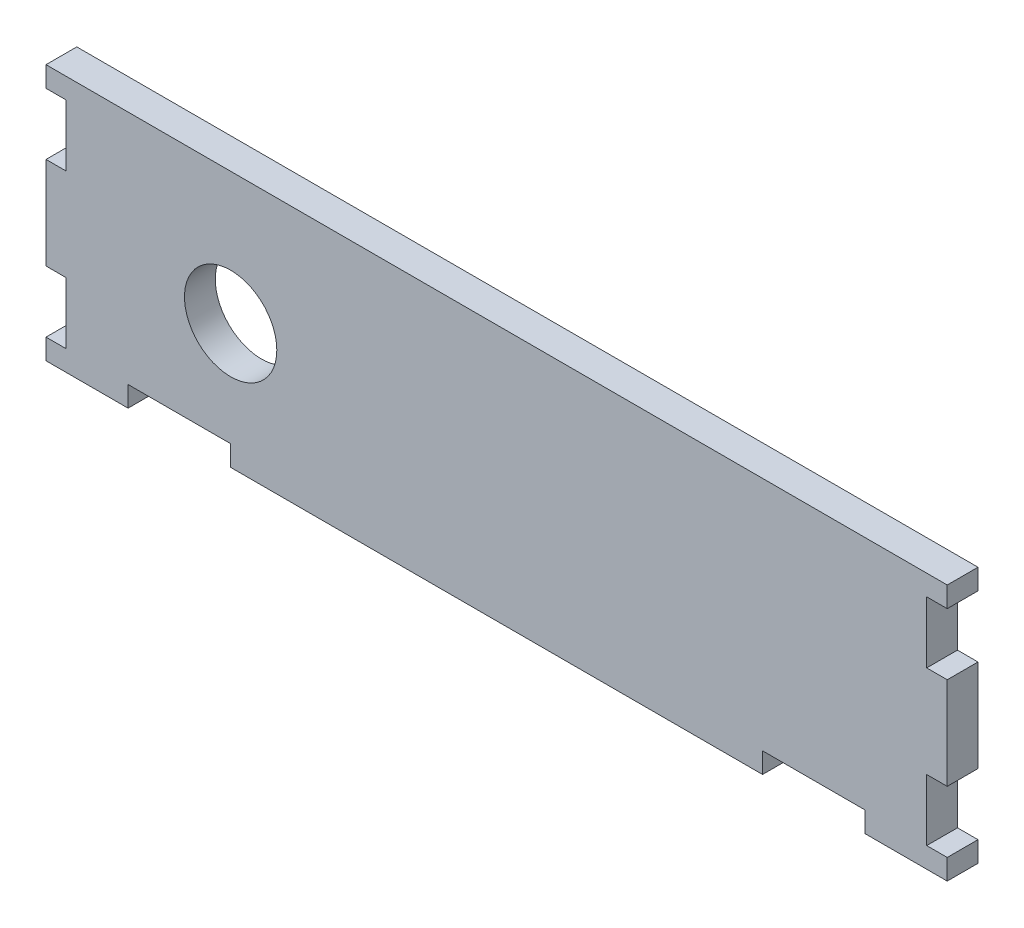
ISO-10303-21;
HEADER;
FILE_DESCRIPTION(('STEP AP214'),'2;1');
FILE_NAME('part.step','',(''),(''),'','','');
FILE_SCHEMA(('AUTOMOTIVE_DESIGN { 1 0 10303 214 1 1 1 1 }'));
ENDSEC;
DATA;
#1=APPLICATION_CONTEXT('core data for automotive mechanical design processes');
#2=APPLICATION_PROTOCOL_DEFINITION('international standard','automotive_design',2000,#1);
#3=PRODUCT_CONTEXT('',#1,'mechanical');
#4=PRODUCT('Part','Part','',(#3));
#5=PRODUCT_RELATED_PRODUCT_CATEGORY('part','',(#4));
#6=PRODUCT_DEFINITION_FORMATION('','',#4);
#7=PRODUCT_DEFINITION_CONTEXT('part definition',#1,'design');
#8=PRODUCT_DEFINITION('design','',#6,#7);
#9=PRODUCT_DEFINITION_SHAPE('','',#8);
#10=(LENGTH_UNIT() NAMED_UNIT(*) SI_UNIT(.MILLI.,.METRE.));
#11=(NAMED_UNIT(*) PLANE_ANGLE_UNIT() SI_UNIT($,.RADIAN.));
#12=(NAMED_UNIT(*) SI_UNIT($,.STERADIAN.) SOLID_ANGLE_UNIT());
#13=UNCERTAINTY_MEASURE_WITH_UNIT(LENGTH_MEASURE(1.E-05),#10,'distance_accuracy_value','');
#14=(GEOMETRIC_REPRESENTATION_CONTEXT(3) GLOBAL_UNCERTAINTY_ASSIGNED_CONTEXT((#13)) GLOBAL_UNIT_ASSIGNED_CONTEXT((#10,
#11,#12)) REPRESENTATION_CONTEXT('',''));
#15=CARTESIAN_POINT('',(0.,0.,0.));
#16=DIRECTION('',(0.,0.,1.));
#17=DIRECTION('',(1.,0.,0.));
#18=AXIS2_PLACEMENT_3D('',#15,#16,#17);
#19=CARTESIAN_POINT('',(7.07447057356267,1.48217303259545,-3.));
#20=DIRECTION('',(0.,0.,1.));
#21=DIRECTION('',(1.,0.,0.));
#22=AXIS2_PLACEMENT_3D('',#19,#20,#21);
#23=CYLINDRICAL_SURFACE('',#22,4.5);
#24=CARTESIAN_POINT('',(7.07447057356267,1.48217303259545,-3.));
#25=DIRECTION('',(0.,0.,1.));
#26=DIRECTION('',(1.,0.,0.));
#27=AXIS2_PLACEMENT_3D('',#24,#25,#26);
#28=CIRCLE('',#27,4.5);
#29=CARTESIAN_POINT('',(11.5744705735627,1.48217303259545,-3.));
#30=VERTEX_POINT('',#29);
#31=EDGE_CURVE('E428',#30,#30,#28,.T.);
#32=ORIENTED_EDGE('',*,*,#31,.F.);
#33=EDGE_LOOP('',(#32));
#34=FACE_BOUND('',#33,.T.);
#35=CARTESIAN_POINT('',(7.07447057356267,1.48217303259545,0.));
#36=DIRECTION('',(0.,0.,1.));
#37=DIRECTION('',(1.,0.,0.));
#38=AXIS2_PLACEMENT_3D('',#35,#36,#37);
#39=CIRCLE('',#38,4.5);
#40=CARTESIAN_POINT('',(11.5744705735627,1.48217303259545,0.));
#41=VERTEX_POINT('',#40);
#42=EDGE_CURVE('E504',#41,#41,#39,.T.);
#43=ORIENTED_EDGE('',*,*,#42,.T.);
#44=EDGE_LOOP('',(#43));
#45=FACE_BOUND('',#44,.T.);
#46=ADVANCED_FACE('F209',(#34,#45),#23,.F.);
#47=CARTESIAN_POINT('',(7.07447057356267,0.,-3.));
#48=DIRECTION('',(-1.,0.,0.));
#49=DIRECTION('',(0.,0.,1.));
#50=AXIS2_PLACEMENT_3D('',#47,#48,#49);
#51=PLANE('',#50);
#52=DIRECTION('',(0.,-1.,0.));
#53=VECTOR('',#52,1.);
#54=CARTESIAN_POINT('',(7.07447057356267,0.,0.));
#55=LINE('',#54,#53);
#56=CARTESIAN_POINT('',(7.07447057356267,-8.66782696740455,0.));
#57=VERTEX_POINT('',#56);
#58=CARTESIAN_POINT('',(7.07447057356267,-10.6678269674046,0.));
#59=VERTEX_POINT('',#58);
#60=EDGE_CURVE('E501',#57,#59,#55,.T.);
#61=ORIENTED_EDGE('',*,*,#60,.F.);
#62=DIRECTION('',(0.,0.,1.));
#63=VECTOR('',#62,1.);
#64=CARTESIAN_POINT('',(7.07447057356267,-8.66782696740455,-3.));
#65=LINE('',#64,#63);
#66=CARTESIAN_POINT('',(7.07447057356267,-8.66782696740455,-3.));
#67=VERTEX_POINT('',#66);
#68=EDGE_CURVE('E315',#67,#57,#65,.T.);
#69=ORIENTED_EDGE('',*,*,#68,.F.);
#70=DIRECTION('',(0.,-1.,0.));
#71=VECTOR('',#70,1.);
#72=CARTESIAN_POINT('',(7.07447057356267,0.,-3.));
#73=LINE('',#72,#71);
#74=CARTESIAN_POINT('',(7.07447057356267,-10.6678269674046,-3.));
#75=VERTEX_POINT('',#74);
#76=EDGE_CURVE('E417',#67,#75,#73,.T.);
#77=ORIENTED_EDGE('',*,*,#76,.T.);
#78=DIRECTION('',(0.,0.,1.));
#79=VECTOR('',#78,1.);
#80=CARTESIAN_POINT('',(7.07447057356267,-10.6678269674046,-3.));
#81=LINE('',#80,#79);
#82=EDGE_CURVE('E322',#75,#59,#81,.T.);
#83=ORIENTED_EDGE('',*,*,#82,.T.);
#84=EDGE_LOOP('',(#61,#69,#77,#83));
#85=FACE_BOUND('',#84,.T.);
#86=ADVANCED_FACE('F747',(#85),#51,.T.);
#87=CARTESIAN_POINT('',(0.,-8.66782696740455,-3.));
#88=DIRECTION('',(0.,-1.,0.));
#89=DIRECTION('',(1.,0.,0.));
#90=AXIS2_PLACEMENT_3D('',#87,#88,#89);
#91=PLANE('',#90);
#92=DIRECTION('',(1.,0.,0.));
#93=VECTOR('',#92,1.);
#94=CARTESIAN_POINT('',(0.,-8.66782696740455,0.));
#95=LINE('',#94,#93);
#96=CARTESIAN_POINT('',(-2.92552942643733,-8.66782696740455,0.));
#97=VERTEX_POINT('',#96);
#98=EDGE_CURVE('E406',#97,#57,#95,.T.);
#99=ORIENTED_EDGE('',*,*,#98,.F.);
#100=DIRECTION('',(0.,0.,1.));
#101=VECTOR('',#100,1.);
#102=CARTESIAN_POINT('',(-2.92552942643733,-8.66782696740455,-3.));
#103=LINE('',#102,#101);
#104=CARTESIAN_POINT('',(-2.92552942643733,-8.66782696740455,-3.));
#105=VERTEX_POINT('',#104);
#106=EDGE_CURVE('E402',#105,#97,#103,.T.);
#107=ORIENTED_EDGE('',*,*,#106,.F.);
#108=DIRECTION('',(1.,0.,0.));
#109=VECTOR('',#108,1.);
#110=CARTESIAN_POINT('',(0.,-8.66782696740455,-3.));
#111=LINE('',#110,#109);
#112=EDGE_CURVE('E405',#105,#67,#111,.T.);
#113=ORIENTED_EDGE('',*,*,#112,.T.);
#114=ORIENTED_EDGE('',*,*,#68,.T.);
#115=EDGE_LOOP('',(#99,#107,#113,#114));
#116=FACE_BOUND('',#115,.T.);
#117=ADVANCED_FACE('F404',(#116),#91,.T.);
#118=CARTESIAN_POINT('',(-2.92552942643733,0.,-3.));
#119=DIRECTION('',(1.,0.,0.));
#120=DIRECTION('',(0.,0.,-1.));
#121=AXIS2_PLACEMENT_3D('',#118,#119,#120);
#122=PLANE('',#121);
#123=DIRECTION('',(0.,1.,0.));
#124=VECTOR('',#123,1.);
#125=CARTESIAN_POINT('',(-2.92552942643733,0.,0.));
#126=LINE('',#125,#124);
#127=CARTESIAN_POINT('',(-2.92552942643733,-10.6678269674046,0.));
#128=VERTEX_POINT('',#127);
#129=EDGE_CURVE('E498',#128,#97,#126,.T.);
#130=ORIENTED_EDGE('',*,*,#129,.F.);
#131=DIRECTION('',(0.,0.,1.));
#132=VECTOR('',#131,1.);
#133=CARTESIAN_POINT('',(-2.92552942643733,-10.6678269674046,-3.));
#134=LINE('',#133,#132);
#135=CARTESIAN_POINT('',(-2.92552942643733,-10.6678269674046,-3.));
#136=VERTEX_POINT('',#135);
#137=EDGE_CURVE('E411',#136,#128,#134,.T.);
#138=ORIENTED_EDGE('',*,*,#137,.F.);
#139=DIRECTION('',(0.,1.,0.));
#140=VECTOR('',#139,1.);
#141=CARTESIAN_POINT('',(-2.92552942643733,0.,-3.));
#142=LINE('',#141,#140);
#143=EDGE_CURVE('E416',#136,#105,#142,.T.);
#144=ORIENTED_EDGE('',*,*,#143,.T.);
#145=ORIENTED_EDGE('',*,*,#106,.T.);
#146=EDGE_LOOP('',(#130,#138,#144,#145));
#147=FACE_BOUND('',#146,.T.);
#148=ADVANCED_FACE('F419',(#147),#122,.T.);
#149=CARTESIAN_POINT('',(0.,-10.6678269674046,-3.));
#150=DIRECTION('',(0.,1.,0.));
#151=DIRECTION('',(0.,0.,1.));
#152=AXIS2_PLACEMENT_3D('',#149,#150,#151);
#153=PLANE('',#152);
#154=DIRECTION('',(-1.,0.,0.));
#155=VECTOR('',#154,1.);
#156=CARTESIAN_POINT('',(0.,-10.6678269674046,0.));
#157=LINE('',#156,#155);
#158=CARTESIAN_POINT('',(-10.9255294264373,-10.6678269674046,0.));
#159=VERTEX_POINT('',#158);
#160=EDGE_CURVE('E495',#128,#159,#157,.T.);
#161=ORIENTED_EDGE('',*,*,#160,.T.);
#162=DIRECTION('',(0.,0.,1.));
#163=VECTOR('',#162,1.);
#164=CARTESIAN_POINT('',(-10.9255294264373,-10.6678269674046,-3.));
#165=LINE('',#164,#163);
#166=CARTESIAN_POINT('',(-10.9255294264373,-10.6678269674046,-3.));
#167=VERTEX_POINT('',#166);
#168=EDGE_CURVE('E510',#167,#159,#165,.T.);
#169=ORIENTED_EDGE('',*,*,#168,.F.);
#170=DIRECTION('',(-1.,0.,0.));
#171=VECTOR('',#170,1.);
#172=CARTESIAN_POINT('',(0.,-10.6678269674046,-3.));
#173=LINE('',#172,#171);
#174=EDGE_CURVE('E421',#136,#167,#173,.T.);
#175=ORIENTED_EDGE('',*,*,#174,.F.);
#176=ORIENTED_EDGE('',*,*,#137,.T.);
#177=EDGE_LOOP('',(#161,#169,#175,#176));
#178=FACE_BOUND('',#177,.T.);
#179=ADVANCED_FACE('F647',(#178),#153,.F.);
#180=CARTESIAN_POINT('',(-10.9255294264374,0.,-3.));
#181=DIRECTION('',(-1.,0.,0.));
#182=DIRECTION('',(0.,-1.,0.));
#183=AXIS2_PLACEMENT_3D('',#180,#181,#182);
#184=PLANE('',#183);
#185=DIRECTION('',(0.,-1.,0.));
#186=VECTOR('',#185,1.);
#187=CARTESIAN_POINT('',(-10.9255294264374,0.,0.));
#188=LINE('',#187,#186);
#189=CARTESIAN_POINT('',(-10.9255294264373,-8.66782696740455,0.));
#190=VERTEX_POINT('',#189);
#191=EDGE_CURVE('E492',#190,#159,#188,.T.);
#192=ORIENTED_EDGE('',*,*,#191,.F.);
#193=DIRECTION('',(0.,0.,1.));
#194=VECTOR('',#193,1.);
#195=CARTESIAN_POINT('',(-10.9255294264373,-8.66782696740455,-3.));
#196=LINE('',#195,#194);
#197=CARTESIAN_POINT('',(-10.9255294264373,-8.66782696740455,-3.));
#198=VERTEX_POINT('',#197);
#199=EDGE_CURVE('E512',#198,#190,#196,.T.);
#200=ORIENTED_EDGE('',*,*,#199,.F.);
#201=DIRECTION('',(0.,-1.,0.));
#202=VECTOR('',#201,1.);
#203=CARTESIAN_POINT('',(-10.9255294264374,0.,-3.));
#204=LINE('',#203,#202);
#205=EDGE_CURVE('E423',#198,#167,#204,.T.);
#206=ORIENTED_EDGE('',*,*,#205,.T.);
#207=ORIENTED_EDGE('',*,*,#168,.T.);
#208=EDGE_LOOP('',(#192,#200,#206,#207));
#209=FACE_BOUND('',#208,.T.);
#210=ADVANCED_FACE('F641',(#209),#184,.T.);
#211=CARTESIAN_POINT('',(0.,-8.66782696740455,-3.));
#212=DIRECTION('',(0.,-1.,0.));
#213=DIRECTION('',(1.,0.,0.));
#214=AXIS2_PLACEMENT_3D('',#211,#212,#213);
#215=PLANE('',#214);
#216=DIRECTION('',(1.,0.,0.));
#217=VECTOR('',#216,1.);
#218=CARTESIAN_POINT('',(0.,-8.66782696740455,0.));
#219=LINE('',#218,#217);
#220=CARTESIAN_POINT('',(-8.98709158260298,-8.66782696740455,0.));
#221=VERTEX_POINT('',#220);
#222=EDGE_CURVE('E489',#190,#221,#219,.T.);
#223=ORIENTED_EDGE('',*,*,#222,.T.);
#224=DIRECTION('',(0.,0.,1.));
#225=VECTOR('',#224,1.);
#226=CARTESIAN_POINT('',(-8.98709158260298,-8.66782696740455,-3.));
#227=LINE('',#226,#225);
#228=CARTESIAN_POINT('',(-8.98709158260298,-8.66782696740455,-3.));
#229=VERTEX_POINT('',#228);
#230=EDGE_CURVE('E514',#229,#221,#227,.T.);
#231=ORIENTED_EDGE('',*,*,#230,.F.);
#232=DIRECTION('',(1.,0.,0.));
#233=VECTOR('',#232,1.);
#234=CARTESIAN_POINT('',(0.,-8.66782696740455,-3.));
#235=LINE('',#234,#233);
#236=EDGE_CURVE('E636',#198,#229,#235,.T.);
#237=ORIENTED_EDGE('',*,*,#236,.F.);
#238=ORIENTED_EDGE('',*,*,#199,.T.);
#239=EDGE_LOOP('',(#223,#231,#237,#238));
#240=FACE_BOUND('',#239,.T.);
#241=ADVANCED_FACE('F657',(#240),#215,.F.);
#242=CARTESIAN_POINT('',(-8.98709158260298,0.,-3.));
#243=DIRECTION('',(-1.,0.,0.));
#244=DIRECTION('',(0.,-1.,0.));
#245=AXIS2_PLACEMENT_3D('',#242,#243,#244);
#246=PLANE('',#245);
#247=DIRECTION('',(0.,-1.,0.));
#248=VECTOR('',#247,1.);
#249=CARTESIAN_POINT('',(-8.98709158260298,0.,0.));
#250=LINE('',#249,#248);
#251=CARTESIAN_POINT('',(-8.98709158260298,-2.66782696740455,0.));
#252=VERTEX_POINT('',#251);
#253=EDGE_CURVE('E480',#252,#221,#250,.T.);
#254=ORIENTED_EDGE('',*,*,#253,.F.);
#255=DIRECTION('',(0.,0.,1.));
#256=VECTOR('',#255,1.);
#257=CARTESIAN_POINT('',(-8.98709158260298,-2.66782696740455,-3.));
#258=LINE('',#257,#256);
#259=CARTESIAN_POINT('',(-8.98709158260298,-2.66782696740455,-3.));
#260=VERTEX_POINT('',#259);
#261=EDGE_CURVE('E516',#260,#252,#258,.T.);
#262=ORIENTED_EDGE('',*,*,#261,.F.);
#263=DIRECTION('',(0.,-1.,0.));
#264=VECTOR('',#263,1.);
#265=CARTESIAN_POINT('',(-8.98709158260298,0.,-3.));
#266=LINE('',#265,#264);
#267=EDGE_CURVE('E627',#260,#229,#266,.T.);
#268=ORIENTED_EDGE('',*,*,#267,.T.);
#269=ORIENTED_EDGE('',*,*,#230,.T.);
#270=EDGE_LOOP('',(#254,#262,#268,#269));
#271=FACE_BOUND('',#270,.T.);
#272=ADVANCED_FACE('F660',(#271),#246,.T.);
#273=CARTESIAN_POINT('',(0.,-2.66782696740452,-3.));
#274=DIRECTION('',(0.,-1.,0.));
#275=DIRECTION('',(1.,0.,0.));
#276=AXIS2_PLACEMENT_3D('',#273,#274,#275);
#277=PLANE('',#276);
#278=DIRECTION('',(1.,0.,0.));
#279=VECTOR('',#278,1.);
#280=CARTESIAN_POINT('',(0.,-2.66782696740452,0.));
#281=LINE('',#280,#279);
#282=CARTESIAN_POINT('',(-10.9255294264373,-2.66782696740455,0.));
#283=VERTEX_POINT('',#282);
#284=EDGE_CURVE('E486',#283,#252,#281,.T.);
#285=ORIENTED_EDGE('',*,*,#284,.F.);
#286=DIRECTION('',(0.,0.,1.));
#287=VECTOR('',#286,1.);
#288=CARTESIAN_POINT('',(-10.9255294264373,-2.66782696740455,-3.));
#289=LINE('',#288,#287);
#290=CARTESIAN_POINT('',(-10.9255294264373,-2.66782696740455,-3.));
#291=VERTEX_POINT('',#290);
#292=EDGE_CURVE('E518',#291,#283,#289,.T.);
#293=ORIENTED_EDGE('',*,*,#292,.F.);
#294=DIRECTION('',(1.,0.,0.));
#295=VECTOR('',#294,1.);
#296=CARTESIAN_POINT('',(0.,-2.66782696740452,-3.));
#297=LINE('',#296,#295);
#298=EDGE_CURVE('E633',#291,#260,#297,.T.);
#299=ORIENTED_EDGE('',*,*,#298,.T.);
#300=ORIENTED_EDGE('',*,*,#261,.T.);
#301=EDGE_LOOP('',(#285,#293,#299,#300));
#302=FACE_BOUND('',#301,.T.);
#303=ADVANCED_FACE('F665',(#302),#277,.T.);
#304=CARTESIAN_POINT('',(-10.9255294264373,0.,-3.));
#305=DIRECTION('',(-1.,0.,0.));
#306=DIRECTION('',(0.,-1.,0.));
#307=AXIS2_PLACEMENT_3D('',#304,#305,#306);
#308=PLANE('',#307);
#309=DIRECTION('',(0.,-1.,0.));
#310=VECTOR('',#309,1.);
#311=CARTESIAN_POINT('',(-10.9255294264373,0.,0.));
#312=LINE('',#311,#310);
#313=CARTESIAN_POINT('',(-10.9255294264373,6.33217303259544,0.));
#314=VERTEX_POINT('',#313);
#315=EDGE_CURVE('E483',#314,#283,#312,.T.);
#316=ORIENTED_EDGE('',*,*,#315,.F.);
#317=DIRECTION('',(0.,0.,1.));
#318=VECTOR('',#317,1.);
#319=CARTESIAN_POINT('',(-10.9255294264373,6.33217303259544,-3.));
#320=LINE('',#319,#318);
#321=CARTESIAN_POINT('',(-10.9255294264373,6.33217303259544,-3.));
#322=VERTEX_POINT('',#321);
#323=EDGE_CURVE('E520',#322,#314,#320,.T.);
#324=ORIENTED_EDGE('',*,*,#323,.F.);
#325=DIRECTION('',(0.,-1.,0.));
#326=VECTOR('',#325,1.);
#327=CARTESIAN_POINT('',(-10.9255294264373,0.,-3.));
#328=LINE('',#327,#326);
#329=EDGE_CURVE('E630',#322,#291,#328,.T.);
#330=ORIENTED_EDGE('',*,*,#329,.T.);
#331=ORIENTED_EDGE('',*,*,#292,.T.);
#332=EDGE_LOOP('',(#316,#324,#330,#331));
#333=FACE_BOUND('',#332,.T.);
#334=ADVANCED_FACE('F668',(#333),#308,.T.);
#335=CARTESIAN_POINT('',(0.,6.33217303259544,-3.));
#336=DIRECTION('',(0.,1.,0.));
#337=DIRECTION('',(-1.,0.,0.));
#338=AXIS2_PLACEMENT_3D('',#335,#336,#337);
#339=PLANE('',#338);
#340=DIRECTION('',(-1.,0.,0.));
#341=VECTOR('',#340,1.);
#342=CARTESIAN_POINT('',(0.,6.33217303259544,0.));
#343=LINE('',#342,#341);
#344=CARTESIAN_POINT('',(-8.98709158260298,6.33217303259544,0.));
#345=VERTEX_POINT('',#344);
#346=EDGE_CURVE('E479',#345,#314,#343,.T.);
#347=ORIENTED_EDGE('',*,*,#346,.F.);
#348=DIRECTION('',(0.,0.,1.));
#349=VECTOR('',#348,1.);
#350=CARTESIAN_POINT('',(-8.98709158260298,6.33217303259544,-3.));
#351=LINE('',#350,#349);
#352=CARTESIAN_POINT('',(-8.98709158260298,6.33217303259544,-3.));
#353=VERTEX_POINT('',#352);
#354=EDGE_CURVE('E522',#353,#345,#351,.T.);
#355=ORIENTED_EDGE('',*,*,#354,.F.);
#356=DIRECTION('',(-1.,0.,0.));
#357=VECTOR('',#356,1.);
#358=CARTESIAN_POINT('',(0.,6.33217303259544,-3.));
#359=LINE('',#358,#357);
#360=EDGE_CURVE('E626',#353,#322,#359,.T.);
#361=ORIENTED_EDGE('',*,*,#360,.T.);
#362=ORIENTED_EDGE('',*,*,#323,.T.);
#363=EDGE_LOOP('',(#347,#355,#361,#362));
#364=FACE_BOUND('',#363,.T.);
#365=ADVANCED_FACE('F673',(#364),#339,.T.);
#366=CARTESIAN_POINT('',(-8.98709158260298,12.3321730325954,0.));
#367=VERTEX_POINT('',#366);
#368=EDGE_CURVE('E476',#367,#345,#250,.T.);
#369=ORIENTED_EDGE('',*,*,#368,.F.);
#370=DIRECTION('',(0.,0.,1.));
#371=VECTOR('',#370,1.);
#372=CARTESIAN_POINT('',(-8.98709158260298,12.3321730325954,-3.));
#373=LINE('',#372,#371);
#374=CARTESIAN_POINT('',(-8.98709158260298,12.3321730325954,-3.));
#375=VERTEX_POINT('',#374);
#376=EDGE_CURVE('E524',#375,#367,#373,.T.);
#377=ORIENTED_EDGE('',*,*,#376,.F.);
#378=EDGE_CURVE('E623',#375,#353,#266,.T.);
#379=ORIENTED_EDGE('',*,*,#378,.T.);
#380=ORIENTED_EDGE('',*,*,#354,.T.);
#381=EDGE_LOOP('',(#369,#377,#379,#380));
#382=FACE_BOUND('',#381,.T.);
#383=ADVANCED_FACE('F676',(#382),#246,.T.);
#384=CARTESIAN_POINT('',(0.,12.3321730325954,-3.));
#385=DIRECTION('',(0.,-1.,0.));
#386=DIRECTION('',(0.,0.,-1.));
#387=AXIS2_PLACEMENT_3D('',#384,#385,#386);
#388=PLANE('',#387);
#389=DIRECTION('',(1.,0.,0.));
#390=VECTOR('',#389,1.);
#391=CARTESIAN_POINT('',(0.,12.3321730325954,0.));
#392=LINE('',#391,#390);
#393=CARTESIAN_POINT('',(-10.9255294264373,12.3321730325954,0.));
#394=VERTEX_POINT('',#393);
#395=EDGE_CURVE('E473',#394,#367,#392,.T.);
#396=ORIENTED_EDGE('',*,*,#395,.F.);
#397=DIRECTION('',(0.,0.,1.));
#398=VECTOR('',#397,1.);
#399=CARTESIAN_POINT('',(-10.9255294264373,12.3321730325954,-3.));
#400=LINE('',#399,#398);
#401=CARTESIAN_POINT('',(-10.9255294264373,12.3321730325954,-3.));
#402=VERTEX_POINT('',#401);
#403=EDGE_CURVE('E526',#402,#394,#400,.T.);
#404=ORIENTED_EDGE('',*,*,#403,.F.);
#405=DIRECTION('',(1.,0.,0.));
#406=VECTOR('',#405,1.);
#407=CARTESIAN_POINT('',(0.,12.3321730325954,-3.));
#408=LINE('',#407,#406);
#409=EDGE_CURVE('E620',#402,#375,#408,.T.);
#410=ORIENTED_EDGE('',*,*,#409,.T.);
#411=ORIENTED_EDGE('',*,*,#376,.T.);
#412=EDGE_LOOP('',(#396,#404,#410,#411));
#413=FACE_BOUND('',#412,.T.);
#414=ADVANCED_FACE('F681',(#413),#388,.T.);
#415=CARTESIAN_POINT('',(-10.9255294264373,0.,-3.));
#416=DIRECTION('',(-1.,0.,0.));
#417=DIRECTION('',(0.,-1.,0.));
#418=AXIS2_PLACEMENT_3D('',#415,#416,#417);
#419=PLANE('',#418);
#420=DIRECTION('',(0.,-1.,0.));
#421=VECTOR('',#420,1.);
#422=CARTESIAN_POINT('',(-10.9255294264373,0.,0.));
#423=LINE('',#422,#421);
#424=CARTESIAN_POINT('',(-10.9255294264373,14.3321730325954,0.));
#425=VERTEX_POINT('',#424);
#426=EDGE_CURVE('E470',#425,#394,#423,.T.);
#427=ORIENTED_EDGE('',*,*,#426,.F.);
#428=DIRECTION('',(0.,0.,1.));
#429=VECTOR('',#428,1.);
#430=CARTESIAN_POINT('',(-10.9255294264373,14.3321730325954,-3.));
#431=LINE('',#430,#429);
#432=CARTESIAN_POINT('',(-10.9255294264373,14.3321730325954,-3.));
#433=VERTEX_POINT('',#432);
#434=EDGE_CURVE('E528',#433,#425,#431,.T.);
#435=ORIENTED_EDGE('',*,*,#434,.F.);
#436=DIRECTION('',(0.,-1.,0.));
#437=VECTOR('',#436,1.);
#438=CARTESIAN_POINT('',(-10.9255294264373,0.,-3.));
#439=LINE('',#438,#437);
#440=EDGE_CURVE('E617',#433,#402,#439,.T.);
#441=ORIENTED_EDGE('',*,*,#440,.T.);
#442=ORIENTED_EDGE('',*,*,#403,.T.);
#443=EDGE_LOOP('',(#427,#435,#441,#442));
#444=FACE_BOUND('',#443,.T.);
#445=ADVANCED_FACE('F684',(#444),#419,.T.);
#446=CARTESIAN_POINT('',(0.,14.3321730325954,-3.));
#447=DIRECTION('',(0.,1.,0.));
#448=DIRECTION('',(-1.,0.,0.));
#449=AXIS2_PLACEMENT_3D('',#446,#447,#448);
#450=PLANE('',#449);
#451=DIRECTION('',(-1.,0.,0.));
#452=VECTOR('',#451,1.);
#453=CARTESIAN_POINT('',(0.,14.3321730325954,0.));
#454=LINE('',#453,#452);
#455=CARTESIAN_POINT('',(76.9288057267098,14.3321730325954,0.));
#456=VERTEX_POINT('',#455);
#457=EDGE_CURVE('E467',#456,#425,#454,.T.);
#458=ORIENTED_EDGE('',*,*,#457,.F.);
#459=DIRECTION('',(0.,0.,1.));
#460=VECTOR('',#459,1.);
#461=CARTESIAN_POINT('',(76.9288057267098,14.3321730325954,-3.));
#462=LINE('',#461,#460);
#463=CARTESIAN_POINT('',(76.9288057267098,14.3321730325954,-3.));
#464=VERTEX_POINT('',#463);
#465=EDGE_CURVE('E530',#464,#456,#462,.T.);
#466=ORIENTED_EDGE('',*,*,#465,.F.);
#467=DIRECTION('',(-1.,0.,0.));
#468=VECTOR('',#467,1.);
#469=CARTESIAN_POINT('',(0.,14.3321730325954,-3.));
#470=LINE('',#469,#468);
#471=EDGE_CURVE('E614',#464,#433,#470,.T.);
#472=ORIENTED_EDGE('',*,*,#471,.T.);
#473=ORIENTED_EDGE('',*,*,#434,.T.);
#474=EDGE_LOOP('',(#458,#466,#472,#473));
#475=FACE_BOUND('',#474,.T.);
#476=ADVANCED_FACE('F688',(#475),#450,.T.);
#477=CARTESIAN_POINT('',(76.9288057267098,0.,-3.));
#478=DIRECTION('',(-1.,0.,0.));
#479=DIRECTION('',(0.,0.,1.));
#480=AXIS2_PLACEMENT_3D('',#477,#478,#479);
#481=PLANE('',#480);
#482=DIRECTION('',(0.,-1.,0.));
#483=VECTOR('',#482,1.);
#484=CARTESIAN_POINT('',(76.9288057267098,0.,0.));
#485=LINE('',#484,#483);
#486=CARTESIAN_POINT('',(76.9288057267098,12.3321730325954,0.));
#487=VERTEX_POINT('',#486);
#488=EDGE_CURVE('E464',#456,#487,#485,.T.);
#489=ORIENTED_EDGE('',*,*,#488,.T.);
#490=DIRECTION('',(0.,0.,1.));
#491=VECTOR('',#490,1.);
#492=CARTESIAN_POINT('',(76.9288057267098,12.3321730325954,-3.));
#493=LINE('',#492,#491);
#494=CARTESIAN_POINT('',(76.9288057267098,12.3321730325954,-3.));
#495=VERTEX_POINT('',#494);
#496=EDGE_CURVE('E532',#495,#487,#493,.T.);
#497=ORIENTED_EDGE('',*,*,#496,.F.);
#498=DIRECTION('',(0.,-1.,0.));
#499=VECTOR('',#498,1.);
#500=CARTESIAN_POINT('',(76.9288057267098,0.,-3.));
#501=LINE('',#500,#499);
#502=EDGE_CURVE('E612',#464,#495,#501,.T.);
#503=ORIENTED_EDGE('',*,*,#502,.F.);
#504=ORIENTED_EDGE('',*,*,#465,.T.);
#505=EDGE_LOOP('',(#489,#497,#503,#504));
#506=FACE_BOUND('',#505,.T.);
#507=ADVANCED_FACE('F693',(#506),#481,.F.);
#508=CARTESIAN_POINT('',(0.,12.3321730325954,-3.));
#509=DIRECTION('',(0.,-1.,0.));
#510=DIRECTION('',(0.,0.,-1.));
#511=AXIS2_PLACEMENT_3D('',#508,#509,#510);
#512=PLANE('',#511);
#513=DIRECTION('',(1.,0.,0.));
#514=VECTOR('',#513,1.);
#515=CARTESIAN_POINT('',(0.,12.3321730325954,0.));
#516=LINE('',#515,#514);
#517=CARTESIAN_POINT('',(74.9288057267098,12.3321730325954,0.));
#518=VERTEX_POINT('',#517);
#519=EDGE_CURVE('E461',#518,#487,#516,.T.);
#520=ORIENTED_EDGE('',*,*,#519,.F.);
#521=DIRECTION('',(0.,0.,1.));
#522=VECTOR('',#521,1.);
#523=CARTESIAN_POINT('',(74.9288057267098,12.3321730325954,-3.));
#524=LINE('',#523,#522);
#525=CARTESIAN_POINT('',(74.9288057267098,12.3321730325954,-3.));
#526=VERTEX_POINT('',#525);
#527=EDGE_CURVE('E534',#526,#518,#524,.T.);
#528=ORIENTED_EDGE('',*,*,#527,.F.);
#529=DIRECTION('',(1.,0.,0.));
#530=VECTOR('',#529,1.);
#531=CARTESIAN_POINT('',(0.,12.3321730325954,-3.));
#532=LINE('',#531,#530);
#533=EDGE_CURVE('E609',#526,#495,#532,.T.);
#534=ORIENTED_EDGE('',*,*,#533,.T.);
#535=ORIENTED_EDGE('',*,*,#496,.T.);
#536=EDGE_LOOP('',(#520,#528,#534,#535));
#537=FACE_BOUND('',#536,.T.);
#538=ADVANCED_FACE('F699',(#537),#512,.T.);
#539=CARTESIAN_POINT('',(74.9288057267098,0.,-3.));
#540=DIRECTION('',(-1.,0.,0.));
#541=DIRECTION('',(0.,0.,1.));
#542=AXIS2_PLACEMENT_3D('',#539,#540,#541);
#543=PLANE('',#542);
#544=DIRECTION('',(0.,-1.,0.));
#545=VECTOR('',#544,1.);
#546=CARTESIAN_POINT('',(74.9288057267098,0.,0.));
#547=LINE('',#546,#545);
#548=CARTESIAN_POINT('',(74.9288057267098,6.33217303259544,0.));
#549=VERTEX_POINT('',#548);
#550=EDGE_CURVE('E453',#518,#549,#547,.T.);
#551=ORIENTED_EDGE('',*,*,#550,.T.);
#552=DIRECTION('',(0.,0.,1.));
#553=VECTOR('',#552,1.);
#554=CARTESIAN_POINT('',(74.9288057267098,6.33217303259544,-3.));
#555=LINE('',#554,#553);
#556=CARTESIAN_POINT('',(74.9288057267098,6.33217303259544,-3.));
#557=VERTEX_POINT('',#556);
#558=EDGE_CURVE('E536',#557,#549,#555,.T.);
#559=ORIENTED_EDGE('',*,*,#558,.F.);
#560=DIRECTION('',(0.,-1.,0.));
#561=VECTOR('',#560,1.);
#562=CARTESIAN_POINT('',(74.9288057267098,0.,-3.));
#563=LINE('',#562,#561);
#564=EDGE_CURVE('E602',#526,#557,#563,.T.);
#565=ORIENTED_EDGE('',*,*,#564,.F.);
#566=ORIENTED_EDGE('',*,*,#527,.T.);
#567=EDGE_LOOP('',(#551,#559,#565,#566));
#568=FACE_BOUND('',#567,.T.);
#569=ADVANCED_FACE('F702',(#568),#543,.F.);
#570=CARTESIAN_POINT('',(0.,6.33217303259544,-3.));
#571=DIRECTION('',(0.,-1.,0.));
#572=DIRECTION('',(0.,0.,-1.));
#573=AXIS2_PLACEMENT_3D('',#570,#571,#572);
#574=PLANE('',#573);
#575=DIRECTION('',(1.,0.,0.));
#576=VECTOR('',#575,1.);
#577=CARTESIAN_POINT('',(0.,6.33217303259544,0.));
#578=LINE('',#577,#576);
#579=CARTESIAN_POINT('',(76.9288057267098,6.33217303259544,0.));
#580=VERTEX_POINT('',#579);
#581=EDGE_CURVE('E459',#549,#580,#578,.T.);
#582=ORIENTED_EDGE('',*,*,#581,.T.);
#583=DIRECTION('',(0.,0.,1.));
#584=VECTOR('',#583,1.);
#585=CARTESIAN_POINT('',(76.9288057267098,6.33217303259544,-3.));
#586=LINE('',#585,#584);
#587=CARTESIAN_POINT('',(76.9288057267098,6.33217303259544,-3.));
#588=VERTEX_POINT('',#587);
#589=EDGE_CURVE('E539',#588,#580,#586,.T.);
#590=ORIENTED_EDGE('',*,*,#589,.F.);
#591=DIRECTION('',(1.,0.,0.));
#592=VECTOR('',#591,1.);
#593=CARTESIAN_POINT('',(0.,6.33217303259544,-3.));
#594=LINE('',#593,#592);
#595=EDGE_CURVE('E607',#557,#588,#594,.T.);
#596=ORIENTED_EDGE('',*,*,#595,.F.);
#597=ORIENTED_EDGE('',*,*,#558,.T.);
#598=EDGE_LOOP('',(#582,#590,#596,#597));
#599=FACE_BOUND('',#598,.T.);
#600=ADVANCED_FACE('F707',(#599),#574,.F.);
#601=CARTESIAN_POINT('',(76.9288057267098,0.,-3.));
#602=DIRECTION('',(-1.,0.,0.));
#603=DIRECTION('',(0.,0.,1.));
#604=AXIS2_PLACEMENT_3D('',#601,#602,#603);
#605=PLANE('',#604);
#606=DIRECTION('',(0.,-1.,0.));
#607=VECTOR('',#606,1.);
#608=CARTESIAN_POINT('',(76.9288057267098,0.,0.));
#609=LINE('',#608,#607);
#610=CARTESIAN_POINT('',(76.9288057267098,-2.66782696740455,0.));
#611=VERTEX_POINT('',#610);
#612=EDGE_CURVE('E456',#580,#611,#609,.T.);
#613=ORIENTED_EDGE('',*,*,#612,.T.);
#614=DIRECTION('',(0.,0.,1.));
#615=VECTOR('',#614,1.);
#616=CARTESIAN_POINT('',(76.9288057267098,-2.66782696740455,-3.));
#617=LINE('',#616,#615);
#618=CARTESIAN_POINT('',(76.9288057267098,-2.66782696740455,-3.));
#619=VERTEX_POINT('',#618);
#620=EDGE_CURVE('E542',#619,#611,#617,.T.);
#621=ORIENTED_EDGE('',*,*,#620,.F.);
#622=DIRECTION('',(0.,-1.,0.));
#623=VECTOR('',#622,1.);
#624=CARTESIAN_POINT('',(76.9288057267098,0.,-3.));
#625=LINE('',#624,#623);
#626=EDGE_CURVE('E605',#588,#619,#625,.T.);
#627=ORIENTED_EDGE('',*,*,#626,.F.);
#628=ORIENTED_EDGE('',*,*,#589,.T.);
#629=EDGE_LOOP('',(#613,#621,#627,#628));
#630=FACE_BOUND('',#629,.T.);
#631=ADVANCED_FACE('F712',(#630),#605,.F.);
#632=CARTESIAN_POINT('',(0.,-2.66782696740455,-3.));
#633=DIRECTION('',(0.,-1.,0.));
#634=DIRECTION('',(0.,0.,-1.));
#635=AXIS2_PLACEMENT_3D('',#632,#633,#634);
#636=PLANE('',#635);
#637=DIRECTION('',(1.,0.,0.));
#638=VECTOR('',#637,1.);
#639=CARTESIAN_POINT('',(0.,-2.66782696740455,0.));
#640=LINE('',#639,#638);
#641=CARTESIAN_POINT('',(74.9288057267098,-2.66782696740455,0.));
#642=VERTEX_POINT('',#641);
#643=EDGE_CURVE('E452',#642,#611,#640,.T.);
#644=ORIENTED_EDGE('',*,*,#643,.F.);
#645=DIRECTION('',(0.,0.,1.));
#646=VECTOR('',#645,1.);
#647=CARTESIAN_POINT('',(74.9288057267098,-2.66782696740455,-3.));
#648=LINE('',#647,#646);
#649=CARTESIAN_POINT('',(74.9288057267098,-2.66782696740455,-3.));
#650=VERTEX_POINT('',#649);
#651=EDGE_CURVE('E544',#650,#642,#648,.T.);
#652=ORIENTED_EDGE('',*,*,#651,.F.);
#653=DIRECTION('',(1.,0.,0.));
#654=VECTOR('',#653,1.);
#655=CARTESIAN_POINT('',(0.,-2.66782696740455,-3.));
#656=LINE('',#655,#654);
#657=EDGE_CURVE('E601',#650,#619,#656,.T.);
#658=ORIENTED_EDGE('',*,*,#657,.T.);
#659=ORIENTED_EDGE('',*,*,#620,.T.);
#660=EDGE_LOOP('',(#644,#652,#658,#659));
#661=FACE_BOUND('',#660,.T.);
#662=ADVANCED_FACE('F716',(#661),#636,.T.);
#663=CARTESIAN_POINT('',(74.9288057267098,-8.66782696740455,0.));
#664=VERTEX_POINT('',#663);
#665=EDGE_CURVE('E450',#642,#664,#547,.T.);
#666=ORIENTED_EDGE('',*,*,#665,.T.);
#667=DIRECTION('',(0.,0.,1.));
#668=VECTOR('',#667,1.);
#669=CARTESIAN_POINT('',(74.9288057267098,-8.66782696740455,-3.));
#670=LINE('',#669,#668);
#671=CARTESIAN_POINT('',(74.9288057267098,-8.66782696740455,-3.));
#672=VERTEX_POINT('',#671);
#673=EDGE_CURVE('E546',#672,#664,#670,.T.);
#674=ORIENTED_EDGE('',*,*,#673,.F.);
#675=EDGE_CURVE('E599',#650,#672,#563,.T.);
#676=ORIENTED_EDGE('',*,*,#675,.F.);
#677=ORIENTED_EDGE('',*,*,#651,.T.);
#678=EDGE_LOOP('',(#666,#674,#676,#677));
#679=FACE_BOUND('',#678,.T.);
#680=ADVANCED_FACE('F721',(#679),#543,.F.);
#681=CARTESIAN_POINT('',(0.,-8.66782696740455,-3.));
#682=DIRECTION('',(0.,-1.,0.));
#683=DIRECTION('',(1.,0.,0.));
#684=AXIS2_PLACEMENT_3D('',#681,#682,#683);
#685=PLANE('',#684);
#686=DIRECTION('',(1.,0.,0.));
#687=VECTOR('',#686,1.);
#688=CARTESIAN_POINT('',(0.,-8.66782696740455,0.));
#689=LINE('',#688,#687);
#690=CARTESIAN_POINT('',(76.9288057267098,-8.66782696740455,0.));
#691=VERTEX_POINT('',#690);
#692=EDGE_CURVE('E448',#664,#691,#689,.T.);
#693=ORIENTED_EDGE('',*,*,#692,.T.);
#694=DIRECTION('',(0.,0.,1.));
#695=VECTOR('',#694,1.);
#696=CARTESIAN_POINT('',(76.9288057267098,-8.66782696740455,-3.));
#697=LINE('',#696,#695);
#698=CARTESIAN_POINT('',(76.9288057267098,-8.66782696740455,-3.));
#699=VERTEX_POINT('',#698);
#700=EDGE_CURVE('E549',#699,#691,#697,.T.);
#701=ORIENTED_EDGE('',*,*,#700,.F.);
#702=DIRECTION('',(1.,0.,0.));
#703=VECTOR('',#702,1.);
#704=CARTESIAN_POINT('',(0.,-8.66782696740455,-3.));
#705=LINE('',#704,#703);
#706=EDGE_CURVE('E597',#672,#699,#705,.T.);
#707=ORIENTED_EDGE('',*,*,#706,.F.);
#708=ORIENTED_EDGE('',*,*,#673,.T.);
#709=EDGE_LOOP('',(#693,#701,#707,#708));
#710=FACE_BOUND('',#709,.T.);
#711=ADVANCED_FACE('F727',(#710),#685,.F.);
#712=CARTESIAN_POINT('',(76.9288057267098,0.,-3.));
#713=DIRECTION('',(-1.,0.,0.));
#714=DIRECTION('',(0.,0.,1.));
#715=AXIS2_PLACEMENT_3D('',#712,#713,#714);
#716=PLANE('',#715);
#717=DIRECTION('',(0.,-1.,0.));
#718=VECTOR('',#717,1.);
#719=CARTESIAN_POINT('',(76.9288057267098,0.,0.));
#720=LINE('',#719,#718);
#721=CARTESIAN_POINT('',(76.9288057267098,-10.6678269674045,0.));
#722=VERTEX_POINT('',#721);
#723=EDGE_CURVE('E446',#691,#722,#720,.T.);
#724=ORIENTED_EDGE('',*,*,#723,.T.);
#725=DIRECTION('',(0.,0.,1.));
#726=VECTOR('',#725,1.);
#727=CARTESIAN_POINT('',(76.9288057267098,-10.6678269674045,-3.));
#728=LINE('',#727,#726);
#729=CARTESIAN_POINT('',(76.9288057267098,-10.6678269674045,-3.));
#730=VERTEX_POINT('',#729);
#731=EDGE_CURVE('E552',#730,#722,#728,.T.);
#732=ORIENTED_EDGE('',*,*,#731,.F.);
#733=DIRECTION('',(0.,-1.,0.));
#734=VECTOR('',#733,1.);
#735=CARTESIAN_POINT('',(76.9288057267098,0.,-3.));
#736=LINE('',#735,#734);
#737=EDGE_CURVE('E595',#699,#730,#736,.T.);
#738=ORIENTED_EDGE('',*,*,#737,.F.);
#739=ORIENTED_EDGE('',*,*,#700,.T.);
#740=EDGE_LOOP('',(#724,#732,#738,#739));
#741=FACE_BOUND('',#740,.T.);
#742=ADVANCED_FACE('F731',(#741),#716,.F.);
#743=CARTESIAN_POINT('',(0.,-10.6678269674046,-3.));
#744=DIRECTION('',(0.,1.,0.));
#745=DIRECTION('',(-1.,0.,0.));
#746=AXIS2_PLACEMENT_3D('',#743,#744,#745);
#747=PLANE('',#746);
#748=DIRECTION('',(-1.,0.,0.));
#749=VECTOR('',#748,1.);
#750=CARTESIAN_POINT('',(0.,-10.6678269674046,0.));
#751=LINE('',#750,#749);
#752=CARTESIAN_POINT('',(68.9288057267098,-10.6678269674046,0.));
#753=VERTEX_POINT('',#752);
#754=EDGE_CURVE('E443',#722,#753,#751,.T.);
#755=ORIENTED_EDGE('',*,*,#754,.T.);
#756=DIRECTION('',(0.,0.,1.));
#757=VECTOR('',#756,1.);
#758=CARTESIAN_POINT('',(68.9288057267098,-10.6678269674046,-3.));
#759=LINE('',#758,#757);
#760=CARTESIAN_POINT('',(68.9288057267098,-10.6678269674046,-3.));
#761=VERTEX_POINT('',#760);
#762=EDGE_CURVE('E555',#761,#753,#759,.T.);
#763=ORIENTED_EDGE('',*,*,#762,.F.);
#764=DIRECTION('',(-1.,0.,0.));
#765=VECTOR('',#764,1.);
#766=CARTESIAN_POINT('',(0.,-10.6678269674046,-3.));
#767=LINE('',#766,#765);
#768=EDGE_CURVE('E593',#730,#761,#767,.T.);
#769=ORIENTED_EDGE('',*,*,#768,.F.);
#770=ORIENTED_EDGE('',*,*,#731,.T.);
#771=EDGE_LOOP('',(#755,#763,#769,#770));
#772=FACE_BOUND('',#771,.T.);
#773=ADVANCED_FACE('F736',(#772),#747,.F.);
#774=CARTESIAN_POINT('',(68.9288057267098,0.,-3.));
#775=DIRECTION('',(-1.,0.,0.));
#776=DIRECTION('',(0.,0.,1.));
#777=AXIS2_PLACEMENT_3D('',#774,#775,#776);
#778=PLANE('',#777);
#779=DIRECTION('',(0.,-1.,0.));
#780=VECTOR('',#779,1.);
#781=CARTESIAN_POINT('',(68.9288057267098,0.,0.));
#782=LINE('',#781,#780);
#783=CARTESIAN_POINT('',(68.9288057267098,-8.66782696740455,0.));
#784=VERTEX_POINT('',#783);
#785=EDGE_CURVE('E440',#784,#753,#782,.T.);
#786=ORIENTED_EDGE('',*,*,#785,.F.);
#787=DIRECTION('',(0.,0.,1.));
#788=VECTOR('',#787,1.);
#789=CARTESIAN_POINT('',(68.9288057267098,-8.66782696740455,-3.));
#790=LINE('',#789,#788);
#791=CARTESIAN_POINT('',(68.9288057267098,-8.66782696740455,-3.));
#792=VERTEX_POINT('',#791);
#793=EDGE_CURVE('E557',#792,#784,#790,.T.);
#794=ORIENTED_EDGE('',*,*,#793,.F.);
#795=DIRECTION('',(0.,-1.,0.));
#796=VECTOR('',#795,1.);
#797=CARTESIAN_POINT('',(68.9288057267098,0.,-3.));
#798=LINE('',#797,#796);
#799=EDGE_CURVE('E590',#792,#761,#798,.T.);
#800=ORIENTED_EDGE('',*,*,#799,.T.);
#801=ORIENTED_EDGE('',*,*,#762,.T.);
#802=EDGE_LOOP('',(#786,#794,#800,#801));
#803=FACE_BOUND('',#802,.T.);
#804=ADVANCED_FACE('F748',(#803),#778,.T.);
#805=CARTESIAN_POINT('',(0.,-8.66782696740455,-3.));
#806=DIRECTION('',(0.,-1.,0.));
#807=DIRECTION('',(1.,0.,0.));
#808=AXIS2_PLACEMENT_3D('',#805,#806,#807);
#809=PLANE('',#808);
#810=DIRECTION('',(1.,0.,0.));
#811=VECTOR('',#810,1.);
#812=CARTESIAN_POINT('',(0.,-8.66782696740455,0.));
#813=LINE('',#812,#811);
#814=CARTESIAN_POINT('',(58.9288057267098,-8.66782696740455,0.));
#815=VERTEX_POINT('',#814);
#816=EDGE_CURVE('E437',#815,#784,#813,.T.);
#817=ORIENTED_EDGE('',*,*,#816,.F.);
#818=DIRECTION('',(0.,0.,1.));
#819=VECTOR('',#818,1.);
#820=CARTESIAN_POINT('',(58.9288057267098,-8.66782696740455,-3.));
#821=LINE('',#820,#819);
#822=CARTESIAN_POINT('',(58.9288057267098,-8.66782696740455,-3.));
#823=VERTEX_POINT('',#822);
#824=EDGE_CURVE('E559',#823,#815,#821,.T.);
#825=ORIENTED_EDGE('',*,*,#824,.F.);
#826=DIRECTION('',(1.,0.,0.));
#827=VECTOR('',#826,1.);
#828=CARTESIAN_POINT('',(0.,-8.66782696740455,-3.));
#829=LINE('',#828,#827);
#830=EDGE_CURVE('E587',#823,#792,#829,.T.);
#831=ORIENTED_EDGE('',*,*,#830,.T.);
#832=ORIENTED_EDGE('',*,*,#793,.T.);
#833=EDGE_LOOP('',(#817,#825,#831,#832));
#834=FACE_BOUND('',#833,.T.);
#835=ADVANCED_FACE('F741',(#834),#809,.T.);
#836=CARTESIAN_POINT('',(58.9288057267098,0.,-3.));
#837=DIRECTION('',(-1.,0.,0.));
#838=DIRECTION('',(0.,0.,1.));
#839=AXIS2_PLACEMENT_3D('',#836,#837,#838);
#840=PLANE('',#839);
#841=DIRECTION('',(0.,-1.,0.));
#842=VECTOR('',#841,1.);
#843=CARTESIAN_POINT('',(58.9288057267098,0.,0.));
#844=LINE('',#843,#842);
#845=CARTESIAN_POINT('',(58.9288057267098,-10.6678269674046,0.));
#846=VERTEX_POINT('',#845);
#847=EDGE_CURVE('E434',#815,#846,#844,.T.);
#848=ORIENTED_EDGE('',*,*,#847,.T.);
#849=DIRECTION('',(0.,0.,1.));
#850=VECTOR('',#849,1.);
#851=CARTESIAN_POINT('',(58.9288057267098,-10.6678269674046,-3.));
#852=LINE('',#851,#850);
#853=CARTESIAN_POINT('',(58.9288057267098,-10.6678269674046,-3.));
#854=VERTEX_POINT('',#853);
#855=EDGE_CURVE('E431',#854,#846,#852,.T.);
#856=ORIENTED_EDGE('',*,*,#855,.F.);
#857=DIRECTION('',(0.,-1.,0.));
#858=VECTOR('',#857,1.);
#859=CARTESIAN_POINT('',(58.9288057267098,0.,-3.));
#860=LINE('',#859,#858);
#861=EDGE_CURVE('E328',#823,#854,#860,.T.);
#862=ORIENTED_EDGE('',*,*,#861,.F.);
#863=ORIENTED_EDGE('',*,*,#824,.T.);
#864=EDGE_LOOP('',(#848,#856,#862,#863));
#865=FACE_BOUND('',#864,.T.);
#866=ADVANCED_FACE('F745',(#865),#840,.F.);
#867=CARTESIAN_POINT('',(0.,-10.6678269674046,-3.));
#868=DIRECTION('',(0.,1.,0.));
#869=DIRECTION('',(0.,0.,1.));
#870=AXIS2_PLACEMENT_3D('',#867,#868,#869);
#871=PLANE('',#870);
#872=DIRECTION('',(-1.,0.,0.));
#873=VECTOR('',#872,1.);
#874=CARTESIAN_POINT('',(0.,-10.6678269674046,0.));
#875=LINE('',#874,#873);
#876=EDGE_CURVE('E432',#846,#59,#875,.T.);
#877=ORIENTED_EDGE('',*,*,#876,.T.);
#878=ORIENTED_EDGE('',*,*,#82,.F.);
#879=DIRECTION('',(-1.,0.,0.));
#880=VECTOR('',#879,1.);
#881=CARTESIAN_POINT('',(0.,-10.6678269674046,-3.));
#882=LINE('',#881,#880);
#883=EDGE_CURVE('E226',#854,#75,#882,.T.);
#884=ORIENTED_EDGE('',*,*,#883,.F.);
#885=ORIENTED_EDGE('',*,*,#855,.T.);
#886=EDGE_LOOP('',(#877,#878,#884,#885));
#887=FACE_BOUND('',#886,.T.);
#888=ADVANCED_FACE('F211',(#887),#871,.F.);
#889=CARTESIAN_POINT('',(0.,0.,0.));
#890=DIRECTION('',(0.,0.,1.));
#891=DIRECTION('',(1.,0.,0.));
#892=AXIS2_PLACEMENT_3D('',#889,#890,#891);
#893=PLANE('',#892);
#894=ORIENTED_EDGE('',*,*,#876,.F.);
#895=ORIENTED_EDGE('',*,*,#847,.F.);
#896=ORIENTED_EDGE('',*,*,#816,.T.);
#897=ORIENTED_EDGE('',*,*,#785,.T.);
#898=ORIENTED_EDGE('',*,*,#754,.F.);
#899=ORIENTED_EDGE('',*,*,#723,.F.);
#900=ORIENTED_EDGE('',*,*,#692,.F.);
#901=ORIENTED_EDGE('',*,*,#665,.F.);
#902=ORIENTED_EDGE('',*,*,#643,.T.);
#903=ORIENTED_EDGE('',*,*,#612,.F.);
#904=ORIENTED_EDGE('',*,*,#581,.F.);
#905=ORIENTED_EDGE('',*,*,#550,.F.);
#906=ORIENTED_EDGE('',*,*,#519,.T.);
#907=ORIENTED_EDGE('',*,*,#488,.F.);
#908=ORIENTED_EDGE('',*,*,#457,.T.);
#909=ORIENTED_EDGE('',*,*,#426,.T.);
#910=ORIENTED_EDGE('',*,*,#395,.T.);
#911=ORIENTED_EDGE('',*,*,#368,.T.);
#912=ORIENTED_EDGE('',*,*,#346,.T.);
#913=ORIENTED_EDGE('',*,*,#315,.T.);
#914=ORIENTED_EDGE('',*,*,#284,.T.);
#915=ORIENTED_EDGE('',*,*,#253,.T.);
#916=ORIENTED_EDGE('',*,*,#222,.F.);
#917=ORIENTED_EDGE('',*,*,#191,.T.);
#918=ORIENTED_EDGE('',*,*,#160,.F.);
#919=ORIENTED_EDGE('',*,*,#129,.T.);
#920=ORIENTED_EDGE('',*,*,#98,.T.);
#921=ORIENTED_EDGE('',*,*,#60,.T.);
#922=EDGE_LOOP('',(#894,#895,#896,#897,#898,#899,#900,#901,#902,#903,#904,#905,#906,#907,#908,
#909,#910,#911,#912,#913,#914,#915,#916,#917,#918,#919,#920,#921));
#923=FACE_BOUND('',#922,.T.);
#924=ORIENTED_EDGE('',*,*,#42,.F.);
#925=EDGE_LOOP('',(#924));
#926=FACE_BOUND('',#925,.T.);
#927=ADVANCED_FACE('F652',(#923,#926),#893,.T.);
#928=CARTESIAN_POINT('',(0.,0.,-3.));
#929=DIRECTION('',(0.,0.,1.));
#930=DIRECTION('',(1.,0.,0.));
#931=AXIS2_PLACEMENT_3D('',#928,#929,#930);
#932=PLANE('',#931);
#933=CARTESIAN_POINT('',(41.8544705735627,1.48217303259546,-3.));
#934=DIRECTION('',(0.,0.,1.));
#935=DIRECTION('',(1.,0.,0.));
#936=AXIS2_PLACEMENT_3D('',#933,#934,#935);
#937=CIRCLE('',#936,4.);
#938=CARTESIAN_POINT('',(45.8544705735627,1.48217303259546,-3.));
#939=VERTEX_POINT('',#938);
#940=EDGE_CURVE('E567',#939,#939,#937,.T.);
#941=ORIENTED_EDGE('',*,*,#940,.T.);
#942=EDGE_LOOP('',(#941));
#943=FACE_BOUND('',#942,.T.);
#944=CARTESIAN_POINT('',(24.3544705735627,1.48217303259545,-3.));
#945=DIRECTION('',(0.,0.,1.));
#946=DIRECTION('',(1.,0.,0.));
#947=AXIS2_PLACEMENT_3D('',#944,#945,#946);
#948=CIRCLE('',#947,4.);
#949=CARTESIAN_POINT('',(28.3544705735627,1.48217303259545,-3.));
#950=VERTEX_POINT('',#949);
#951=EDGE_CURVE('E435',#950,#950,#948,.T.);
#952=ORIENTED_EDGE('',*,*,#951,.T.);
#953=EDGE_LOOP('',(#952));
#954=FACE_BOUND('',#953,.T.);
#955=ORIENTED_EDGE('',*,*,#883,.T.);
#956=ORIENTED_EDGE('',*,*,#76,.F.);
#957=ORIENTED_EDGE('',*,*,#112,.F.);
#958=ORIENTED_EDGE('',*,*,#143,.F.);
#959=ORIENTED_EDGE('',*,*,#174,.T.);
#960=ORIENTED_EDGE('',*,*,#205,.F.);
#961=ORIENTED_EDGE('',*,*,#236,.T.);
#962=ORIENTED_EDGE('',*,*,#267,.F.);
#963=ORIENTED_EDGE('',*,*,#298,.F.);
#964=ORIENTED_EDGE('',*,*,#329,.F.);
#965=ORIENTED_EDGE('',*,*,#360,.F.);
#966=ORIENTED_EDGE('',*,*,#378,.F.);
#967=ORIENTED_EDGE('',*,*,#409,.F.);
#968=ORIENTED_EDGE('',*,*,#440,.F.);
#969=ORIENTED_EDGE('',*,*,#471,.F.);
#970=ORIENTED_EDGE('',*,*,#502,.T.);
#971=ORIENTED_EDGE('',*,*,#533,.F.);
#972=ORIENTED_EDGE('',*,*,#564,.T.);
#973=ORIENTED_EDGE('',*,*,#595,.T.);
#974=ORIENTED_EDGE('',*,*,#626,.T.);
#975=ORIENTED_EDGE('',*,*,#657,.F.);
#976=ORIENTED_EDGE('',*,*,#675,.T.);
#977=ORIENTED_EDGE('',*,*,#706,.T.);
#978=ORIENTED_EDGE('',*,*,#737,.T.);
#979=ORIENTED_EDGE('',*,*,#768,.T.);
#980=ORIENTED_EDGE('',*,*,#799,.F.);
#981=ORIENTED_EDGE('',*,*,#830,.F.);
#982=ORIENTED_EDGE('',*,*,#861,.T.);
#983=EDGE_LOOP('',(#955,#956,#957,#958,#959,#960,#961,#962,#963,#964,#965,#966,#967,#968,#969,
#970,#971,#972,#973,#974,#975,#976,#977,#978,#979,#980,#981,#982));
#984=FACE_BOUND('',#983,.T.);
#985=ORIENTED_EDGE('',*,*,#31,.T.);
#986=EDGE_LOOP('',(#985));
#987=FACE_BOUND('',#986,.T.);
#988=ADVANCED_FACE('F414',(#943,#954,#984,#987),#932,.F.);
#989=CARTESIAN_POINT('',(24.3544705735627,1.48217303259545,-5.5));
#990=DIRECTION('',(0.,0.,1.));
#991=DIRECTION('',(1.,0.,0.));
#992=AXIS2_PLACEMENT_3D('',#989,#990,#991);
#993=CYLINDRICAL_SURFACE('',#992,4.);
#994=CARTESIAN_POINT('',(24.3544705735627,1.48217303259545,-5.5));
#995=DIRECTION('',(0.,0.,1.));
#996=DIRECTION('',(1.,0.,0.));
#997=AXIS2_PLACEMENT_3D('',#994,#995,#996);
#998=CIRCLE('',#997,4.);
#999=CARTESIAN_POINT('',(28.3544705735627,1.48217303259545,-5.5));
#1000=VERTEX_POINT('',#999);
#1001=EDGE_CURVE('E569',#1000,#1000,#998,.T.);
#1002=ORIENTED_EDGE('',*,*,#1001,.T.);
#1003=EDGE_LOOP('',(#1002));
#1004=FACE_BOUND('',#1003,.T.);
#1005=ORIENTED_EDGE('',*,*,#951,.F.);
#1006=EDGE_LOOP('',(#1005));
#1007=FACE_BOUND('',#1006,.T.);
#1008=ADVANCED_FACE('F862',(#1004,#1007),#993,.T.);
#1009=CARTESIAN_POINT('',(24.3544705735627,1.48217303259545,-5.5));
#1010=DIRECTION('',(0.,0.,1.));
#1011=DIRECTION('',(1.,0.,0.));
#1012=AXIS2_PLACEMENT_3D('',#1009,#1010,#1011);
#1013=CYLINDRICAL_SURFACE('',#1012,2.);
#1014=CARTESIAN_POINT('',(24.3544705735627,1.48217303259545,-5.5));
#1015=DIRECTION('',(0.,0.,1.));
#1016=DIRECTION('',(1.,0.,0.));
#1017=AXIS2_PLACEMENT_3D('',#1014,#1015,#1016);
#1018=CIRCLE('',#1017,2.);
#1019=CARTESIAN_POINT('',(26.3544705735627,1.48217303259545,-5.5));
#1020=VERTEX_POINT('',#1019);
#1021=EDGE_CURVE('E566',#1020,#1020,#1018,.T.);
#1022=ORIENTED_EDGE('',*,*,#1021,.F.);
#1023=EDGE_LOOP('',(#1022));
#1024=FACE_BOUND('',#1023,.T.);
#1025=CARTESIAN_POINT('',(24.3544705735627,1.48217303259545,-3.));
#1026=DIRECTION('',(0.,0.,1.));
#1027=DIRECTION('',(1.,0.,0.));
#1028=AXIS2_PLACEMENT_3D('',#1025,#1026,#1027);
#1029=CIRCLE('',#1028,2.);
#1030=CARTESIAN_POINT('',(26.3544705735627,1.48217303259545,-3.));
#1031=VERTEX_POINT('',#1030);
#1032=EDGE_CURVE('E218',#1031,#1031,#1029,.T.);
#1033=ORIENTED_EDGE('',*,*,#1032,.T.);
#1034=EDGE_LOOP('',(#1033));
#1035=FACE_BOUND('',#1034,.T.);
#1036=ADVANCED_FACE('F874',(#1024,#1035),#1013,.F.);
#1037=CARTESIAN_POINT('',(0.,0.,-5.5));
#1038=DIRECTION('',(0.,0.,1.));
#1039=DIRECTION('',(1.,0.,0.));
#1040=AXIS2_PLACEMENT_3D('',#1037,#1038,#1039);
#1041=PLANE('',#1040);
#1042=ORIENTED_EDGE('',*,*,#1001,.F.);
#1043=EDGE_LOOP('',(#1042));
#1044=FACE_BOUND('',#1043,.T.);
#1045=ORIENTED_EDGE('',*,*,#1021,.T.);
#1046=EDGE_LOOP('',(#1045));
#1047=FACE_BOUND('',#1046,.T.);
#1048=ADVANCED_FACE('F885',(#1044,#1047),#1041,.F.);
#1049=ORIENTED_EDGE('',*,*,#1032,.F.);
#1050=EDGE_LOOP('',(#1049));
#1051=FACE_BOUND('',#1050,.T.);
#1052=ADVANCED_FACE('F864',(#1051),#932,.F.);
#1053=CARTESIAN_POINT('',(41.8544705735627,1.48217303259546,-5.5));
#1054=DIRECTION('',(0.,0.,1.));
#1055=DIRECTION('',(1.,0.,0.));
#1056=AXIS2_PLACEMENT_3D('',#1053,#1054,#1055);
#1057=CYLINDRICAL_SURFACE('',#1056,2.);
#1058=CARTESIAN_POINT('',(41.8544705735627,1.48217303259546,-5.5));
#1059=DIRECTION('',(0.,0.,1.));
#1060=DIRECTION('',(1.,0.,0.));
#1061=AXIS2_PLACEMENT_3D('',#1058,#1059,#1060);
#1062=CIRCLE('',#1061,2.);
#1063=CARTESIAN_POINT('',(43.8544705735627,1.48217303259546,-5.5));
#1064=VERTEX_POINT('',#1063);
#1065=EDGE_CURVE('E576',#1064,#1064,#1062,.T.);
#1066=ORIENTED_EDGE('',*,*,#1065,.F.);
#1067=EDGE_LOOP('',(#1066));
#1068=FACE_BOUND('',#1067,.T.);
#1069=CARTESIAN_POINT('',(41.8544705735627,1.48217303259546,-3.));
#1070=DIRECTION('',(0.,0.,1.));
#1071=DIRECTION('',(1.,0.,0.));
#1072=AXIS2_PLACEMENT_3D('',#1069,#1070,#1071);
#1073=CIRCLE('',#1072,2.);
#1074=CARTESIAN_POINT('',(43.8544705735627,1.48217303259546,-3.));
#1075=VERTEX_POINT('',#1074);
#1076=EDGE_CURVE('E12',#1075,#1075,#1073,.T.);
#1077=ORIENTED_EDGE('',*,*,#1076,.T.);
#1078=EDGE_LOOP('',(#1077));
#1079=FACE_BOUND('',#1078,.T.);
#1080=ADVANCED_FACE('F906',(#1068,#1079),#1057,.F.);
#1081=CARTESIAN_POINT('',(41.8544705735627,1.48217303259546,-5.5));
#1082=DIRECTION('',(0.,0.,1.));
#1083=DIRECTION('',(1.,0.,0.));
#1084=AXIS2_PLACEMENT_3D('',#1081,#1082,#1083);
#1085=CYLINDRICAL_SURFACE('',#1084,4.);
#1086=CARTESIAN_POINT('',(41.8544705735627,1.48217303259546,-5.5));
#1087=DIRECTION('',(0.,0.,1.));
#1088=DIRECTION('',(1.,0.,0.));
#1089=AXIS2_PLACEMENT_3D('',#1086,#1087,#1088);
#1090=CIRCLE('',#1089,4.);
#1091=CARTESIAN_POINT('',(45.8544705735627,1.48217303259546,-5.5));
#1092=VERTEX_POINT('',#1091);
#1093=EDGE_CURVE('E570',#1092,#1092,#1090,.T.);
#1094=ORIENTED_EDGE('',*,*,#1093,.T.);
#1095=EDGE_LOOP('',(#1094));
#1096=FACE_BOUND('',#1095,.T.);
#1097=ORIENTED_EDGE('',*,*,#940,.F.);
#1098=EDGE_LOOP('',(#1097));
#1099=FACE_BOUND('',#1098,.T.);
#1100=ADVANCED_FACE('F916',(#1096,#1099),#1085,.T.);
#1101=CARTESIAN_POINT('',(0.,0.,-5.5));
#1102=DIRECTION('',(0.,0.,1.));
#1103=DIRECTION('',(1.,0.,0.));
#1104=AXIS2_PLACEMENT_3D('',#1101,#1102,#1103);
#1105=PLANE('',#1104);
#1106=ORIENTED_EDGE('',*,*,#1065,.T.);
#1107=EDGE_LOOP('',(#1106));
#1108=FACE_BOUND('',#1107,.T.);
#1109=ORIENTED_EDGE('',*,*,#1093,.F.);
#1110=EDGE_LOOP('',(#1109));
#1111=FACE_BOUND('',#1110,.T.);
#1112=ADVANCED_FACE('F926',(#1108,#1111),#1105,.F.);
#1113=ORIENTED_EDGE('',*,*,#1076,.F.);
#1114=EDGE_LOOP('',(#1113));
#1115=FACE_BOUND('',#1114,.T.);
#1116=ADVANCED_FACE('F863',(#1115),#932,.F.);
#1117=CLOSED_SHELL('',(#46,#86,#117,#148,#179,#210,#241,#272,#303,#334,#365,#383,#414,#445,#476,
#507,#538,#569,#600,#631,#662,#680,#711,#742,#773,#804,#835,#866,#888,#927,#988,#1008,#1036,
#1048,#1052,#1080,#1100,#1112,#1116));
#1118=MANIFOLD_SOLID_BREP('B2',#1117);
#1119=ADVANCED_BREP_SHAPE_REPRESENTATION('',(#18,#1118),#14);
#1120=SHAPE_DEFINITION_REPRESENTATION(#9,#1119);
ENDSEC;
END-ISO-10303-21;
